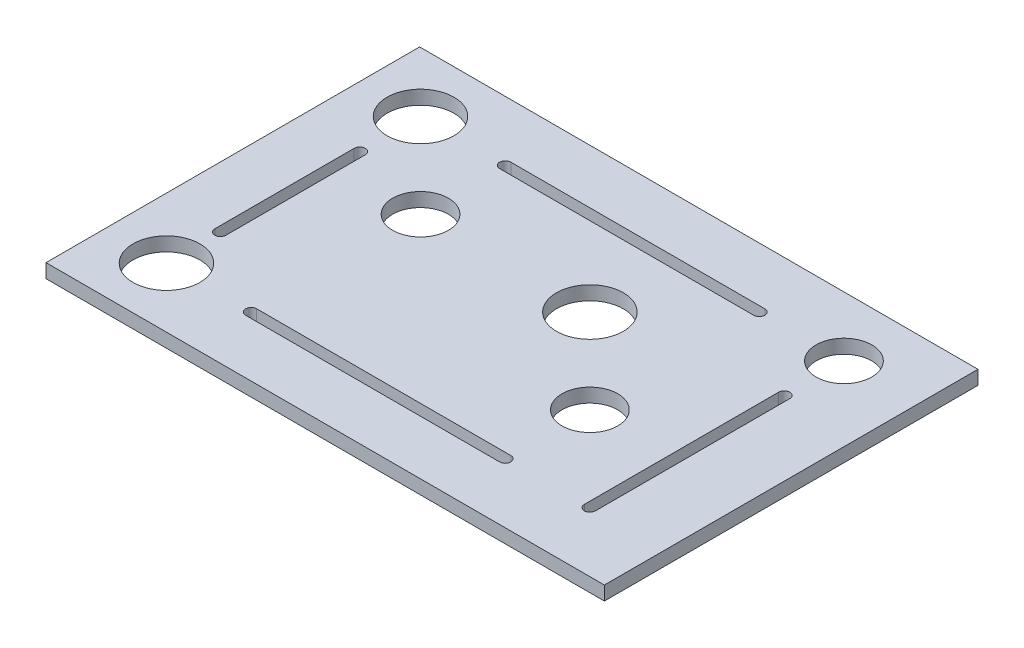
ISO-10303-21;
HEADER;
FILE_DESCRIPTION(('STEP AP214'),'2;1');
FILE_NAME('part.step','',(''),(''),'','','');
FILE_SCHEMA(('AUTOMOTIVE_DESIGN { 1 0 10303 214 1 1 1 1 }'));
ENDSEC;
DATA;
#1=APPLICATION_CONTEXT('core data for automotive mechanical design processes');
#2=APPLICATION_PROTOCOL_DEFINITION('international standard','automotive_design',2000,#1);
#3=PRODUCT_CONTEXT('',#1,'mechanical');
#4=PRODUCT('Part','Part','',(#3));
#5=PRODUCT_RELATED_PRODUCT_CATEGORY('part','',(#4));
#6=PRODUCT_DEFINITION_FORMATION('','',#4);
#7=PRODUCT_DEFINITION_CONTEXT('part definition',#1,'design');
#8=PRODUCT_DEFINITION('design','',#6,#7);
#9=PRODUCT_DEFINITION_SHAPE('','',#8);
#10=(LENGTH_UNIT() NAMED_UNIT(*) SI_UNIT(.MILLI.,.METRE.));
#11=(NAMED_UNIT(*) PLANE_ANGLE_UNIT() SI_UNIT($,.RADIAN.));
#12=(NAMED_UNIT(*) SI_UNIT($,.STERADIAN.) SOLID_ANGLE_UNIT());
#13=UNCERTAINTY_MEASURE_WITH_UNIT(LENGTH_MEASURE(1.E-05),#10,'distance_accuracy_value','');
#14=(GEOMETRIC_REPRESENTATION_CONTEXT(3) GLOBAL_UNCERTAINTY_ASSIGNED_CONTEXT((#13)) GLOBAL_UNIT_ASSIGNED_CONTEXT((#10,
#11,#12)) REPRESENTATION_CONTEXT('',''));
#15=CARTESIAN_POINT('',(0.,0.,0.));
#16=DIRECTION('',(0.,0.,1.));
#17=DIRECTION('',(1.,0.,0.));
#18=AXIS2_PLACEMENT_3D('',#15,#16,#17);
#19=CARTESIAN_POINT('',(0.,3.175,0.));
#20=DIRECTION('',(0.,0.,1.));
#21=DIRECTION('',(1.,0.,0.));
#22=AXIS2_PLACEMENT_3D('',#19,#20,#21);
#23=PLANE('',#22);
#24=DIRECTION('',(-1.,0.,0.));
#25=VECTOR('',#24,1.);
#26=CARTESIAN_POINT('',(0.,0.,0.));
#27=LINE('',#26,#25);
#28=CARTESIAN_POINT('',(0.,0.,0.));
#29=VERTEX_POINT('',#28);
#30=CARTESIAN_POINT('',(-127.25,0.,0.));
#31=VERTEX_POINT('',#30);
#32=EDGE_CURVE('E342',#29,#31,#27,.T.);
#33=ORIENTED_EDGE('',*,*,#32,.F.);
#34=DIRECTION('',(0.,-1.,0.));
#35=VECTOR('',#34,1.);
#36=CARTESIAN_POINT('',(0.,3.175,0.));
#37=LINE('',#36,#35);
#38=CARTESIAN_POINT('',(0.,3.175,0.));
#39=VERTEX_POINT('',#38);
#40=EDGE_CURVE('E11',#39,#29,#37,.T.);
#41=ORIENTED_EDGE('',*,*,#40,.F.);
#42=DIRECTION('',(-1.,0.,0.));
#43=VECTOR('',#42,1.);
#44=CARTESIAN_POINT('',(0.,3.175,0.));
#45=LINE('',#44,#43);
#46=CARTESIAN_POINT('',(-127.25,3.175,0.));
#47=VERTEX_POINT('',#46);
#48=EDGE_CURVE('E345',#39,#47,#45,.T.);
#49=ORIENTED_EDGE('',*,*,#48,.T.);
#50=DIRECTION('',(0.,-1.,0.));
#51=VECTOR('',#50,1.);
#52=CARTESIAN_POINT('',(-127.25,3.175,0.));
#53=LINE('',#52,#51);
#54=EDGE_CURVE('E41',#47,#31,#53,.T.);
#55=ORIENTED_EDGE('',*,*,#54,.T.);
#56=EDGE_LOOP('',(#33,#41,#49,#55));
#57=FACE_BOUND('',#56,.T.);
#58=ADVANCED_FACE('F38',(#57),#23,.T.);
#59=CARTESIAN_POINT('',(0.,3.175,0.));
#60=DIRECTION('',(-1.,0.,0.));
#61=DIRECTION('',(0.,0.,1.));
#62=AXIS2_PLACEMENT_3D('',#59,#60,#61);
#63=PLANE('',#62);
#64=DIRECTION('',(0.,0.,-1.));
#65=VECTOR('',#64,1.);
#66=CARTESIAN_POINT('',(0.,0.,0.));
#67=LINE('',#66,#65);
#68=CARTESIAN_POINT('',(0.,0.,-85.1500000000001));
#69=VERTEX_POINT('',#68);
#70=EDGE_CURVE('E349',#29,#69,#67,.T.);
#71=ORIENTED_EDGE('',*,*,#70,.T.);
#72=DIRECTION('',(0.,-1.,0.));
#73=VECTOR('',#72,1.);
#74=CARTESIAN_POINT('',(0.,3.175,-85.1500000000001));
#75=LINE('',#74,#73);
#76=CARTESIAN_POINT('',(0.,3.175,-85.1500000000001));
#77=VERTEX_POINT('',#76);
#78=EDGE_CURVE('E46',#77,#69,#75,.T.);
#79=ORIENTED_EDGE('',*,*,#78,.F.);
#80=DIRECTION('',(0.,0.,-1.));
#81=VECTOR('',#80,1.);
#82=CARTESIAN_POINT('',(0.,3.175,0.));
#83=LINE('',#82,#81);
#84=EDGE_CURVE('E354',#39,#77,#83,.T.);
#85=ORIENTED_EDGE('',*,*,#84,.F.);
#86=ORIENTED_EDGE('',*,*,#40,.T.);
#87=EDGE_LOOP('',(#71,#79,#85,#86));
#88=FACE_BOUND('',#87,.T.);
#89=ADVANCED_FACE('F380',(#88),#63,.F.);
#90=CARTESIAN_POINT('',(0.,3.175,-85.1500000000001));
#91=DIRECTION('',(0.,0.,1.));
#92=DIRECTION('',(1.,0.,0.));
#93=AXIS2_PLACEMENT_3D('',#90,#91,#92);
#94=PLANE('',#93);
#95=DIRECTION('',(-1.,0.,0.));
#96=VECTOR('',#95,1.);
#97=CARTESIAN_POINT('',(0.,0.,-85.1500000000001));
#98=LINE('',#97,#96);
#99=CARTESIAN_POINT('',(-127.25,0.,-85.15));
#100=VERTEX_POINT('',#99);
#101=EDGE_CURVE('E361',#69,#100,#98,.T.);
#102=ORIENTED_EDGE('',*,*,#101,.T.);
#103=DIRECTION('',(0.,-1.,0.));
#104=VECTOR('',#103,1.);
#105=CARTESIAN_POINT('',(-127.25,3.175,-85.15));
#106=LINE('',#105,#104);
#107=CARTESIAN_POINT('',(-127.25,3.175,-85.15));
#108=VERTEX_POINT('',#107);
#109=EDGE_CURVE('E366',#108,#100,#106,.T.);
#110=ORIENTED_EDGE('',*,*,#109,.F.);
#111=DIRECTION('',(-1.,0.,0.));
#112=VECTOR('',#111,1.);
#113=CARTESIAN_POINT('',(0.,3.175,-85.1500000000001));
#114=LINE('',#113,#112);
#115=EDGE_CURVE('E352',#77,#108,#114,.T.);
#116=ORIENTED_EDGE('',*,*,#115,.F.);
#117=ORIENTED_EDGE('',*,*,#78,.T.);
#118=EDGE_LOOP('',(#102,#110,#116,#117));
#119=FACE_BOUND('',#118,.T.);
#120=ADVANCED_FACE('F384',(#119),#94,.F.);
#121=CARTESIAN_POINT('',(-127.25,3.175,0.));
#122=DIRECTION('',(-1.,0.,0.));
#123=DIRECTION('',(0.,0.,1.));
#124=AXIS2_PLACEMENT_3D('',#121,#122,#123);
#125=PLANE('',#124);
#126=DIRECTION('',(0.,0.,-1.));
#127=VECTOR('',#126,1.);
#128=CARTESIAN_POINT('',(-127.25,0.,0.));
#129=LINE('',#128,#127);
#130=EDGE_CURVE('E358',#31,#100,#129,.T.);
#131=ORIENTED_EDGE('',*,*,#130,.F.);
#132=ORIENTED_EDGE('',*,*,#54,.F.);
#133=DIRECTION('',(0.,0.,-1.));
#134=VECTOR('',#133,1.);
#135=CARTESIAN_POINT('',(-127.25,3.175,0.));
#136=LINE('',#135,#134);
#137=EDGE_CURVE('E348',#47,#108,#136,.T.);
#138=ORIENTED_EDGE('',*,*,#137,.T.);
#139=ORIENTED_EDGE('',*,*,#109,.T.);
#140=EDGE_LOOP('',(#131,#132,#138,#139));
#141=FACE_BOUND('',#140,.T.);
#142=ADVANCED_FACE('F374',(#141),#125,.T.);
#143=CARTESIAN_POINT('',(0.,3.175,0.));
#144=DIRECTION('',(0.,-1.,0.));
#145=DIRECTION('',(0.,0.,-1.));
#146=AXIS2_PLACEMENT_3D('',#143,#144,#145);
#147=PLANE('',#146);
#148=DIRECTION('',(0.,0.,-1.));
#149=VECTOR('',#148,1.);
#150=CARTESIAN_POINT('',(-15.6549999999995,3.175,-13.6250000000001));
#151=LINE('',#150,#149);
#152=CARTESIAN_POINT('',(-15.6549999999995,3.175,-13.6250000000001));
#153=VERTEX_POINT('',#152);
#154=CARTESIAN_POINT('',(-15.6550000000003,3.175,-57.9140062974979));
#155=VERTEX_POINT('',#154);
#156=EDGE_CURVE('E205',#153,#155,#151,.T.);
#157=ORIENTED_EDGE('',*,*,#156,.F.);
#158=CARTESIAN_POINT('',(-16.9249999999998,3.175,-13.6250000000001));
#159=DIRECTION('',(0.,1.,0.));
#160=DIRECTION('',(0.,0.,1.));
#161=AXIS2_PLACEMENT_3D('',#158,#159,#160);
#162=CIRCLE('',#161,1.27);
#163=CARTESIAN_POINT('',(-18.1949999999995,3.175,-13.6250000000001));
#164=VERTEX_POINT('',#163);
#165=EDGE_CURVE('E54',#164,#153,#162,.T.);
#166=ORIENTED_EDGE('',*,*,#165,.F.);
#167=DIRECTION('',(0.,0.,1.));
#168=VECTOR('',#167,1.);
#169=CARTESIAN_POINT('',(-18.1949999999995,3.175,-13.6250000000001));
#170=LINE('',#169,#168);
#171=CARTESIAN_POINT('',(-18.1949999999995,3.175,-57.9140062974979));
#172=VERTEX_POINT('',#171);
#173=EDGE_CURVE('E196',#172,#164,#170,.T.);
#174=ORIENTED_EDGE('',*,*,#173,.F.);
#175=CARTESIAN_POINT('',(-16.925,3.175,-57.9140062974979));
#176=DIRECTION('',(0.,1.,0.));
#177=DIRECTION('',(0.,0.,1.));
#178=AXIS2_PLACEMENT_3D('',#175,#176,#177);
#179=CIRCLE('',#178,1.26999999999969);
#180=EDGE_CURVE('E199',#155,#172,#179,.T.);
#181=ORIENTED_EDGE('',*,*,#180,.F.);
#182=EDGE_LOOP('',(#157,#166,#174,#181));
#183=FACE_BOUND('',#182,.T.);
#184=DIRECTION('',(-1.,0.,0.));
#185=VECTOR('',#184,1.);
#186=CARTESIAN_POINT('',(-36.225,3.175,-72.7949999999999));
#187=LINE('',#186,#185);
#188=CARTESIAN_POINT('',(-36.225,3.175,-72.7949999999999));
#189=VERTEX_POINT('',#188);
#190=CARTESIAN_POINT('',(-94.125,3.175,-72.7949999999995));
#191=VERTEX_POINT('',#190);
#192=EDGE_CURVE('E231',#189,#191,#187,.T.);
#193=ORIENTED_EDGE('',*,*,#192,.F.);
#194=CARTESIAN_POINT('',(-36.225,3.175,-71.5249999999999));
#195=DIRECTION('',(0.,1.,0.));
#196=DIRECTION('',(0.,0.,1.));
#197=AXIS2_PLACEMENT_3D('',#194,#195,#196);
#198=CIRCLE('',#197,1.26999999999999);
#199=CARTESIAN_POINT('',(-36.225,3.175,-70.2549999999999));
#200=VERTEX_POINT('',#199);
#201=EDGE_CURVE('E62',#200,#189,#198,.T.);
#202=ORIENTED_EDGE('',*,*,#201,.F.);
#203=DIRECTION('',(1.,0.,0.));
#204=VECTOR('',#203,1.);
#205=CARTESIAN_POINT('',(-36.225,3.175,-70.2549999999999));
#206=LINE('',#205,#204);
#207=CARTESIAN_POINT('',(-94.125,3.175,-70.2549999999999));
#208=VERTEX_POINT('',#207);
#209=EDGE_CURVE('E220',#208,#200,#206,.T.);
#210=ORIENTED_EDGE('',*,*,#209,.F.);
#211=CARTESIAN_POINT('',(-94.125,3.175,-71.5249999999995));
#212=DIRECTION('',(0.,1.,0.));
#213=DIRECTION('',(0.,0.,1.));
#214=AXIS2_PLACEMENT_3D('',#211,#212,#213);
#215=CIRCLE('',#214,1.27);
#216=EDGE_CURVE('E235',#191,#208,#215,.T.);
#217=ORIENTED_EDGE('',*,*,#216,.F.);
#218=EDGE_LOOP('',(#193,#202,#210,#217));
#219=FACE_BOUND('',#218,.T.);
#220=DIRECTION('',(0.,0.,-1.));
#221=VECTOR('',#220,1.);
#222=CARTESIAN_POINT('',(-112.155,3.175,-25.9052815058638));
#223=LINE('',#222,#221);
#224=CARTESIAN_POINT('',(-112.155,3.175,-25.9052815058638));
#225=VERTEX_POINT('',#224);
#226=CARTESIAN_POINT('',(-112.155,3.175,-57.6832088778083));
#227=VERTEX_POINT('',#226);
#228=EDGE_CURVE('E262',#225,#227,#223,.T.);
#229=ORIENTED_EDGE('',*,*,#228,.F.);
#230=CARTESIAN_POINT('',(-113.425,3.175,-25.9052815058638));
#231=DIRECTION('',(0.,1.,0.));
#232=DIRECTION('',(0.,0.,1.));
#233=AXIS2_PLACEMENT_3D('',#230,#231,#232);
#234=CIRCLE('',#233,1.26999999999999);
#235=CARTESIAN_POINT('',(-114.695,3.175,-25.9052815058638));
#236=VERTEX_POINT('',#235);
#237=EDGE_CURVE('E260',#236,#225,#234,.T.);
#238=ORIENTED_EDGE('',*,*,#237,.F.);
#239=DIRECTION('',(0.,0.,1.));
#240=VECTOR('',#239,1.);
#241=CARTESIAN_POINT('',(-114.695,3.175,-25.9052815058638));
#242=LINE('',#241,#240);
#243=CARTESIAN_POINT('',(-114.695,3.175,-57.6832088778083));
#244=VERTEX_POINT('',#243);
#245=EDGE_CURVE('E250',#244,#236,#242,.T.);
#246=ORIENTED_EDGE('',*,*,#245,.F.);
#247=CARTESIAN_POINT('',(-113.425,3.175,-57.6832088778083));
#248=DIRECTION('',(0.,1.,0.));
#249=DIRECTION('',(0.,0.,1.));
#250=AXIS2_PLACEMENT_3D('',#247,#248,#249);
#251=CIRCLE('',#250,1.26999999999999);
#252=EDGE_CURVE('E266',#227,#244,#251,.T.);
#253=ORIENTED_EDGE('',*,*,#252,.F.);
#254=EDGE_LOOP('',(#229,#238,#246,#253));
#255=FACE_BOUND('',#254,.T.);
#256=DIRECTION('',(-1.,0.,0.));
#257=VECTOR('',#256,1.);
#258=CARTESIAN_POINT('',(-36.225,3.175,-14.8950000000001));
#259=LINE('',#258,#257);
#260=CARTESIAN_POINT('',(-36.225,3.175,-14.8950000000001));
#261=VERTEX_POINT('',#260);
#262=CARTESIAN_POINT('',(-94.125,3.175,-14.8950000000001));
#263=VERTEX_POINT('',#262);
#264=EDGE_CURVE('E294',#261,#263,#259,.T.);
#265=ORIENTED_EDGE('',*,*,#264,.F.);
#266=CARTESIAN_POINT('',(-36.225,3.175,-13.6250000000001));
#267=DIRECTION('',(0.,1.,0.));
#268=DIRECTION('',(0.,0.,-1.));
#269=AXIS2_PLACEMENT_3D('',#266,#267,#268);
#270=CIRCLE('',#269,1.26999999999999);
#271=CARTESIAN_POINT('',(-36.225,3.175,-12.3550000000001));
#272=VERTEX_POINT('',#271);
#273=EDGE_CURVE('E292',#272,#261,#270,.T.);
#274=ORIENTED_EDGE('',*,*,#273,.F.);
#275=DIRECTION('',(1.,0.,0.));
#276=VECTOR('',#275,1.);
#277=CARTESIAN_POINT('',(-36.225,3.175,-12.3550000000001));
#278=LINE('',#277,#276);
#279=CARTESIAN_POINT('',(-94.125,3.175,-12.3550000000005));
#280=VERTEX_POINT('',#279);
#281=EDGE_CURVE('E282',#280,#272,#278,.T.);
#282=ORIENTED_EDGE('',*,*,#281,.F.);
#283=CARTESIAN_POINT('',(-94.125,3.175,-13.6250000000005));
#284=DIRECTION('',(0.,1.,0.));
#285=DIRECTION('',(0.,0.,-1.));
#286=AXIS2_PLACEMENT_3D('',#283,#284,#285);
#287=CIRCLE('',#286,1.27);
#288=EDGE_CURVE('E297',#263,#280,#287,.T.);
#289=ORIENTED_EDGE('',*,*,#288,.F.);
#290=EDGE_LOOP('',(#265,#274,#282,#289));
#291=FACE_BOUND('',#290,.T.);
#292=CARTESIAN_POINT('',(-113.425,3.175,-71.5249999999994));
#293=DIRECTION('',(0.,-1.,0.));
#294=DIRECTION('',(0.,0.,-1.));
#295=AXIS2_PLACEMENT_3D('',#292,#293,#294);
#296=CIRCLE('',#295,7.62);
#297=CARTESIAN_POINT('',(-113.425,3.175,-79.1449999999994));
#298=VERTEX_POINT('',#297);
#299=EDGE_CURVE('E309',#298,#298,#296,.T.);
#300=ORIENTED_EDGE('',*,*,#299,.T.);
#301=EDGE_LOOP('',(#300));
#302=FACE_BOUND('',#301,.T.);
#303=CARTESIAN_POINT('',(-113.425,3.175,-13.6249999999994));
#304=DIRECTION('',(0.,-1.,0.));
#305=DIRECTION('',(0.,0.,-1.));
#306=AXIS2_PLACEMENT_3D('',#303,#304,#305);
#307=CIRCLE('',#306,7.62);
#308=CARTESIAN_POINT('',(-113.425,3.175,-21.2449999999994));
#309=VERTEX_POINT('',#308);
#310=EDGE_CURVE('E316',#309,#309,#307,.T.);
#311=ORIENTED_EDGE('',*,*,#310,.T.);
#312=EDGE_LOOP('',(#311));
#313=FACE_BOUND('',#312,.T.);
#314=CARTESIAN_POINT('',(-94.125,3.175,-52.2249999999995));
#315=DIRECTION('',(0.,-1.,0.));
#316=DIRECTION('',(0.,0.,-1.));
#317=AXIS2_PLACEMENT_3D('',#314,#315,#316);
#318=CIRCLE('',#317,6.35);
#319=CARTESIAN_POINT('',(-94.125,3.175,-58.5749999999995));
#320=VERTEX_POINT('',#319);
#321=EDGE_CURVE('E322',#320,#320,#318,.T.);
#322=ORIENTED_EDGE('',*,*,#321,.T.);
#323=EDGE_LOOP('',(#322));
#324=FACE_BOUND('',#323,.T.);
#325=CARTESIAN_POINT('',(-55.5249999999998,3.175,-52.2249999999998));
#326=DIRECTION('',(0.,-1.,0.));
#327=DIRECTION('',(0.,0.,-1.));
#328=AXIS2_PLACEMENT_3D('',#325,#326,#327);
#329=CIRCLE('',#328,7.62);
#330=CARTESIAN_POINT('',(-55.5249999999998,3.175,-59.8449999999998));
#331=VERTEX_POINT('',#330);
#332=EDGE_CURVE('E328',#331,#331,#329,.T.);
#333=ORIENTED_EDGE('',*,*,#332,.T.);
#334=EDGE_LOOP('',(#333));
#335=FACE_BOUND('',#334,.T.);
#336=CARTESIAN_POINT('',(-36.2249999999996,3.175,-32.9249999999999));
#337=DIRECTION('',(0.,-1.,0.));
#338=DIRECTION('',(0.,0.,-1.));
#339=AXIS2_PLACEMENT_3D('',#336,#337,#338);
#340=CIRCLE('',#339,6.35);
#341=CARTESIAN_POINT('',(-36.2249999999996,3.175,-39.2749999999999));
#342=VERTEX_POINT('',#341);
#343=EDGE_CURVE('E334',#342,#342,#340,.T.);
#344=ORIENTED_EDGE('',*,*,#343,.T.);
#345=EDGE_LOOP('',(#344));
#346=FACE_BOUND('',#345,.T.);
#347=CARTESIAN_POINT('',(-16.925,3.175,-71.5250000000001));
#348=DIRECTION('',(0.,1.,0.));
#349=DIRECTION('',(0.,0.,1.));
#350=AXIS2_PLACEMENT_3D('',#347,#348,#349);
#351=CIRCLE('',#350,6.35);
#352=CARTESIAN_POINT('',(-16.925,3.175,-65.1750000000001));
#353=VERTEX_POINT('',#352);
#354=EDGE_CURVE('E312',#353,#353,#351,.T.);
#355=ORIENTED_EDGE('',*,*,#354,.F.);
#356=EDGE_LOOP('',(#355));
#357=FACE_BOUND('',#356,.T.);
#358=ORIENTED_EDGE('',*,*,#48,.F.);
#359=ORIENTED_EDGE('',*,*,#84,.T.);
#360=ORIENTED_EDGE('',*,*,#115,.T.);
#361=ORIENTED_EDGE('',*,*,#137,.F.);
#362=EDGE_LOOP('',(#358,#359,#360,#361));
#363=FACE_BOUND('',#362,.T.);
#364=ADVANCED_FACE('F386',(#183,#219,#255,#291,#302,#313,#324,#335,#346,#357,#363),#147,.F.);
#365=CARTESIAN_POINT('',(0.,0.,0.));
#366=DIRECTION('',(0.,-1.,0.));
#367=DIRECTION('',(0.,0.,-1.));
#368=AXIS2_PLACEMENT_3D('',#365,#366,#367);
#369=PLANE('',#368);
#370=CARTESIAN_POINT('',(-16.9249999999998,0.,-13.6250000000001));
#371=DIRECTION('',(0.,1.,0.));
#372=DIRECTION('',(0.,0.,1.));
#373=AXIS2_PLACEMENT_3D('',#370,#371,#372);
#374=CIRCLE('',#373,1.27);
#375=CARTESIAN_POINT('',(-18.1949999999995,0.,-13.6250000000001));
#376=VERTEX_POINT('',#375);
#377=CARTESIAN_POINT('',(-15.6549999999995,0.,-13.6250000000001));
#378=VERTEX_POINT('',#377);
#379=EDGE_CURVE('E177',#376,#378,#374,.T.);
#380=ORIENTED_EDGE('',*,*,#379,.T.);
#381=DIRECTION('',(0.,0.,-1.));
#382=VECTOR('',#381,1.);
#383=CARTESIAN_POINT('',(-15.6549999999995,0.,-13.6250000000001));
#384=LINE('',#383,#382);
#385=CARTESIAN_POINT('',(-15.6550000000001,0.,-57.9140062974979));
#386=VERTEX_POINT('',#385);
#387=EDGE_CURVE('E187',#378,#386,#384,.T.);
#388=ORIENTED_EDGE('',*,*,#387,.T.);
#389=CARTESIAN_POINT('',(-16.925,0.,-57.9140062974979));
#390=DIRECTION('',(0.,1.,0.));
#391=DIRECTION('',(0.,0.,1.));
#392=AXIS2_PLACEMENT_3D('',#389,#390,#391);
#393=CIRCLE('',#392,1.26999999999969);
#394=CARTESIAN_POINT('',(-18.1949999999995,0.,-57.9140062974979));
#395=VERTEX_POINT('',#394);
#396=EDGE_CURVE('E191',#386,#395,#393,.T.);
#397=ORIENTED_EDGE('',*,*,#396,.T.);
#398=DIRECTION('',(0.,0.,1.));
#399=VECTOR('',#398,1.);
#400=CARTESIAN_POINT('',(-18.1949999999995,0.,-13.6250000000001));
#401=LINE('',#400,#399);
#402=EDGE_CURVE('E183',#395,#376,#401,.T.);
#403=ORIENTED_EDGE('',*,*,#402,.T.);
#404=EDGE_LOOP('',(#380,#388,#397,#403));
#405=FACE_BOUND('',#404,.T.);
#406=CARTESIAN_POINT('',(-36.225,0.,-71.5249999999999));
#407=DIRECTION('',(0.,1.,0.));
#408=DIRECTION('',(0.,0.,1.));
#409=AXIS2_PLACEMENT_3D('',#406,#407,#408);
#410=CIRCLE('',#409,1.26999999999999);
#411=CARTESIAN_POINT('',(-36.225,0.,-70.2549999999999));
#412=VERTEX_POINT('',#411);
#413=CARTESIAN_POINT('',(-36.225,0.,-72.7949999999999));
#414=VERTEX_POINT('',#413);
#415=EDGE_CURVE('E216',#412,#414,#410,.T.);
#416=ORIENTED_EDGE('',*,*,#415,.T.);
#417=DIRECTION('',(-1.,0.,0.));
#418=VECTOR('',#417,1.);
#419=CARTESIAN_POINT('',(-36.225,0.,-72.7949999999999));
#420=LINE('',#419,#418);
#421=CARTESIAN_POINT('',(-94.125,0.,-72.7949999999999));
#422=VERTEX_POINT('',#421);
#423=EDGE_CURVE('E219',#414,#422,#420,.T.);
#424=ORIENTED_EDGE('',*,*,#423,.T.);
#425=CARTESIAN_POINT('',(-94.125,0.,-71.5249999999995));
#426=DIRECTION('',(0.,1.,0.));
#427=DIRECTION('',(0.,0.,1.));
#428=AXIS2_PLACEMENT_3D('',#425,#426,#427);
#429=CIRCLE('',#428,1.27);
#430=CARTESIAN_POINT('',(-94.125,0.,-70.2549999999999));
#431=VERTEX_POINT('',#430);
#432=EDGE_CURVE('E223',#422,#431,#429,.T.);
#433=ORIENTED_EDGE('',*,*,#432,.T.);
#434=DIRECTION('',(1.,0.,0.));
#435=VECTOR('',#434,1.);
#436=CARTESIAN_POINT('',(-36.225,0.,-70.2549999999999));
#437=LINE('',#436,#435);
#438=EDGE_CURVE('E226',#431,#412,#437,.T.);
#439=ORIENTED_EDGE('',*,*,#438,.T.);
#440=EDGE_LOOP('',(#416,#424,#433,#439));
#441=FACE_BOUND('',#440,.T.);
#442=CARTESIAN_POINT('',(-113.425,0.,-25.9052815058638));
#443=DIRECTION('',(0.,1.,0.));
#444=DIRECTION('',(0.,0.,1.));
#445=AXIS2_PLACEMENT_3D('',#442,#443,#444);
#446=CIRCLE('',#445,1.26999999999999);
#447=CARTESIAN_POINT('',(-114.695,0.,-25.9052815058638));
#448=VERTEX_POINT('',#447);
#449=CARTESIAN_POINT('',(-112.155,0.,-25.9052815058638));
#450=VERTEX_POINT('',#449);
#451=EDGE_CURVE('E246',#448,#450,#446,.T.);
#452=ORIENTED_EDGE('',*,*,#451,.T.);
#453=DIRECTION('',(0.,0.,-1.));
#454=VECTOR('',#453,1.);
#455=CARTESIAN_POINT('',(-112.155,0.,-25.9052815058638));
#456=LINE('',#455,#454);
#457=CARTESIAN_POINT('',(-112.155,0.,-57.6832088778083));
#458=VERTEX_POINT('',#457);
#459=EDGE_CURVE('E249',#450,#458,#456,.T.);
#460=ORIENTED_EDGE('',*,*,#459,.T.);
#461=CARTESIAN_POINT('',(-113.425,0.,-57.6832088778083));
#462=DIRECTION('',(0.,1.,0.));
#463=DIRECTION('',(0.,0.,1.));
#464=AXIS2_PLACEMENT_3D('',#461,#462,#463);
#465=CIRCLE('',#464,1.26999999999999);
#466=CARTESIAN_POINT('',(-114.695,0.,-57.6832088778083));
#467=VERTEX_POINT('',#466);
#468=EDGE_CURVE('E253',#458,#467,#465,.T.);
#469=ORIENTED_EDGE('',*,*,#468,.T.);
#470=DIRECTION('',(0.,0.,1.));
#471=VECTOR('',#470,1.);
#472=CARTESIAN_POINT('',(-114.695,0.,-25.9052815058638));
#473=LINE('',#472,#471);
#474=EDGE_CURVE('E256',#467,#448,#473,.T.);
#475=ORIENTED_EDGE('',*,*,#474,.T.);
#476=EDGE_LOOP('',(#452,#460,#469,#475));
#477=FACE_BOUND('',#476,.T.);
#478=CARTESIAN_POINT('',(-36.225,0.,-13.6250000000001));
#479=DIRECTION('',(0.,1.,0.));
#480=DIRECTION('',(0.,0.,-1.));
#481=AXIS2_PLACEMENT_3D('',#478,#479,#480);
#482=CIRCLE('',#481,1.26999999999999);
#483=CARTESIAN_POINT('',(-36.225,0.,-12.3550000000001));
#484=VERTEX_POINT('',#483);
#485=CARTESIAN_POINT('',(-36.225,0.,-14.8950000000001));
#486=VERTEX_POINT('',#485);
#487=EDGE_CURVE('E278',#484,#486,#482,.T.);
#488=ORIENTED_EDGE('',*,*,#487,.T.);
#489=DIRECTION('',(-1.,0.,0.));
#490=VECTOR('',#489,1.);
#491=CARTESIAN_POINT('',(-36.225,0.,-14.8950000000001));
#492=LINE('',#491,#490);
#493=CARTESIAN_POINT('',(-94.125,0.,-14.8950000000001));
#494=VERTEX_POINT('',#493);
#495=EDGE_CURVE('E281',#486,#494,#492,.T.);
#496=ORIENTED_EDGE('',*,*,#495,.T.);
#497=CARTESIAN_POINT('',(-94.125,0.,-13.6250000000005));
#498=DIRECTION('',(0.,1.,0.));
#499=DIRECTION('',(0.,0.,-1.));
#500=AXIS2_PLACEMENT_3D('',#497,#498,#499);
#501=CIRCLE('',#500,1.27);
#502=CARTESIAN_POINT('',(-94.125,0.,-12.3550000000005));
#503=VERTEX_POINT('',#502);
#504=EDGE_CURVE('E285',#494,#503,#501,.T.);
#505=ORIENTED_EDGE('',*,*,#504,.T.);
#506=DIRECTION('',(1.,0.,0.));
#507=VECTOR('',#506,1.);
#508=CARTESIAN_POINT('',(-36.225,0.,-12.3550000000001));
#509=LINE('',#508,#507);
#510=EDGE_CURVE('E288',#503,#484,#509,.T.);
#511=ORIENTED_EDGE('',*,*,#510,.T.);
#512=EDGE_LOOP('',(#488,#496,#505,#511));
#513=FACE_BOUND('',#512,.T.);
#514=CARTESIAN_POINT('',(-113.425,0.,-71.5249999999994));
#515=DIRECTION('',(0.,-1.,0.));
#516=DIRECTION('',(0.,0.,-1.));
#517=AXIS2_PLACEMENT_3D('',#514,#515,#516);
#518=CIRCLE('',#517,7.62);
#519=CARTESIAN_POINT('',(-113.425,0.,-79.1449999999994));
#520=VERTEX_POINT('',#519);
#521=EDGE_CURVE('E313',#520,#520,#518,.T.);
#522=ORIENTED_EDGE('',*,*,#521,.F.);
#523=EDGE_LOOP('',(#522));
#524=FACE_BOUND('',#523,.T.);
#525=CARTESIAN_POINT('',(-113.425,0.,-13.6249999999994));
#526=DIRECTION('',(0.,-1.,0.));
#527=DIRECTION('',(0.,0.,-1.));
#528=AXIS2_PLACEMENT_3D('',#525,#526,#527);
#529=CIRCLE('',#528,7.62);
#530=CARTESIAN_POINT('',(-113.425,0.,-21.2449999999994));
#531=VERTEX_POINT('',#530);
#532=EDGE_CURVE('E319',#531,#531,#529,.T.);
#533=ORIENTED_EDGE('',*,*,#532,.F.);
#534=EDGE_LOOP('',(#533));
#535=FACE_BOUND('',#534,.T.);
#536=CARTESIAN_POINT('',(-94.125,0.,-52.2249999999995));
#537=DIRECTION('',(0.,-1.,0.));
#538=DIRECTION('',(0.,0.,-1.));
#539=AXIS2_PLACEMENT_3D('',#536,#537,#538);
#540=CIRCLE('',#539,6.35);
#541=CARTESIAN_POINT('',(-94.125,0.,-58.5749999999995));
#542=VERTEX_POINT('',#541);
#543=EDGE_CURVE('E325',#542,#542,#540,.T.);
#544=ORIENTED_EDGE('',*,*,#543,.F.);
#545=EDGE_LOOP('',(#544));
#546=FACE_BOUND('',#545,.T.);
#547=CARTESIAN_POINT('',(-55.5249999999998,0.,-52.2249999999998));
#548=DIRECTION('',(0.,-1.,0.));
#549=DIRECTION('',(0.,0.,-1.));
#550=AXIS2_PLACEMENT_3D('',#547,#548,#549);
#551=CIRCLE('',#550,7.62);
#552=CARTESIAN_POINT('',(-55.5249999999998,0.,-59.8449999999998));
#553=VERTEX_POINT('',#552);
#554=EDGE_CURVE('E331',#553,#553,#551,.T.);
#555=ORIENTED_EDGE('',*,*,#554,.F.);
#556=EDGE_LOOP('',(#555));
#557=FACE_BOUND('',#556,.T.);
#558=CARTESIAN_POINT('',(-36.2249999999996,0.,-32.9249999999999));
#559=DIRECTION('',(0.,-1.,0.));
#560=DIRECTION('',(0.,0.,-1.));
#561=AXIS2_PLACEMENT_3D('',#558,#559,#560);
#562=CIRCLE('',#561,6.35);
#563=CARTESIAN_POINT('',(-36.2249999999996,0.,-39.2749999999999));
#564=VERTEX_POINT('',#563);
#565=EDGE_CURVE('E212',#564,#564,#562,.T.);
#566=ORIENTED_EDGE('',*,*,#565,.F.);
#567=EDGE_LOOP('',(#566));
#568=FACE_BOUND('',#567,.T.);
#569=CARTESIAN_POINT('',(-16.925,0.,-71.5250000000001));
#570=DIRECTION('',(0.,1.,0.));
#571=DIRECTION('',(0.,0.,1.));
#572=AXIS2_PLACEMENT_3D('',#569,#570,#571);
#573=CIRCLE('',#572,6.35);
#574=CARTESIAN_POINT('',(-16.925,0.,-65.1750000000001));
#575=VERTEX_POINT('',#574);
#576=EDGE_CURVE('E339',#575,#575,#573,.T.);
#577=ORIENTED_EDGE('',*,*,#576,.T.);
#578=EDGE_LOOP('',(#577));
#579=FACE_BOUND('',#578,.T.);
#580=ORIENTED_EDGE('',*,*,#32,.T.);
#581=ORIENTED_EDGE('',*,*,#130,.T.);
#582=ORIENTED_EDGE('',*,*,#101,.F.);
#583=ORIENTED_EDGE('',*,*,#70,.F.);
#584=EDGE_LOOP('',(#580,#581,#582,#583));
#585=FACE_BOUND('',#584,.T.);
#586=ADVANCED_FACE('F193',(#405,#441,#477,#513,#524,#535,#546,#557,#568,#579,#585),#369,.T.);
#587=CARTESIAN_POINT('',(-16.925,0.,-71.5250000000001));
#588=DIRECTION('',(0.,1.,0.));
#589=DIRECTION('',(0.,0.,1.));
#590=AXIS2_PLACEMENT_3D('',#587,#588,#589);
#591=CYLINDRICAL_SURFACE('',#590,6.35);
#592=ORIENTED_EDGE('',*,*,#576,.F.);
#593=EDGE_LOOP('',(#592));
#594=FACE_BOUND('',#593,.T.);
#595=ORIENTED_EDGE('',*,*,#354,.T.);
#596=EDGE_LOOP('',(#595));
#597=FACE_BOUND('',#596,.T.);
#598=ADVANCED_FACE('F394',(#594,#597),#591,.F.);
#599=CARTESIAN_POINT('',(-36.2249999999996,3.175,-32.9249999999999));
#600=DIRECTION('',(0.,-1.,0.));
#601=DIRECTION('',(0.,0.,-1.));
#602=AXIS2_PLACEMENT_3D('',#599,#600,#601);
#603=CYLINDRICAL_SURFACE('',#602,6.35);
#604=ORIENTED_EDGE('',*,*,#343,.F.);
#605=EDGE_LOOP('',(#604));
#606=FACE_BOUND('',#605,.T.);
#607=ORIENTED_EDGE('',*,*,#565,.T.);
#608=EDGE_LOOP('',(#607));
#609=FACE_BOUND('',#608,.T.);
#610=ADVANCED_FACE('F423',(#606,#609),#603,.F.);
#611=CARTESIAN_POINT('',(-55.5249999999998,3.175,-52.2249999999998));
#612=DIRECTION('',(0.,-1.,0.));
#613=DIRECTION('',(0.,0.,-1.));
#614=AXIS2_PLACEMENT_3D('',#611,#612,#613);
#615=CYLINDRICAL_SURFACE('',#614,7.62);
#616=ORIENTED_EDGE('',*,*,#332,.F.);
#617=EDGE_LOOP('',(#616));
#618=FACE_BOUND('',#617,.T.);
#619=ORIENTED_EDGE('',*,*,#554,.T.);
#620=EDGE_LOOP('',(#619));
#621=FACE_BOUND('',#620,.T.);
#622=ADVANCED_FACE('F433',(#618,#621),#615,.F.);
#623=CARTESIAN_POINT('',(-94.125,3.175,-52.2249999999995));
#624=DIRECTION('',(0.,-1.,0.));
#625=DIRECTION('',(0.,0.,-1.));
#626=AXIS2_PLACEMENT_3D('',#623,#624,#625);
#627=CYLINDRICAL_SURFACE('',#626,6.35);
#628=ORIENTED_EDGE('',*,*,#321,.F.);
#629=EDGE_LOOP('',(#628));
#630=FACE_BOUND('',#629,.T.);
#631=ORIENTED_EDGE('',*,*,#543,.T.);
#632=EDGE_LOOP('',(#631));
#633=FACE_BOUND('',#632,.T.);
#634=ADVANCED_FACE('F443',(#630,#633),#627,.F.);
#635=CARTESIAN_POINT('',(-113.425,3.175,-13.6249999999994));
#636=DIRECTION('',(0.,-1.,0.));
#637=DIRECTION('',(0.,0.,-1.));
#638=AXIS2_PLACEMENT_3D('',#635,#636,#637);
#639=CYLINDRICAL_SURFACE('',#638,7.62);
#640=ORIENTED_EDGE('',*,*,#310,.F.);
#641=EDGE_LOOP('',(#640));
#642=FACE_BOUND('',#641,.T.);
#643=ORIENTED_EDGE('',*,*,#532,.T.);
#644=EDGE_LOOP('',(#643));
#645=FACE_BOUND('',#644,.T.);
#646=ADVANCED_FACE('F453',(#642,#645),#639,.F.);
#647=CARTESIAN_POINT('',(-113.425,3.175,-71.5249999999994));
#648=DIRECTION('',(0.,-1.,0.));
#649=DIRECTION('',(0.,0.,-1.));
#650=AXIS2_PLACEMENT_3D('',#647,#648,#649);
#651=CYLINDRICAL_SURFACE('',#650,7.62);
#652=ORIENTED_EDGE('',*,*,#299,.F.);
#653=EDGE_LOOP('',(#652));
#654=FACE_BOUND('',#653,.T.);
#655=ORIENTED_EDGE('',*,*,#521,.T.);
#656=EDGE_LOOP('',(#655));
#657=FACE_BOUND('',#656,.T.);
#658=ADVANCED_FACE('F463',(#654,#657),#651,.F.);
#659=CARTESIAN_POINT('',(-36.225,0.,-13.6250000000001));
#660=DIRECTION('',(0.,1.,0.));
#661=DIRECTION('',(0.,0.,1.));
#662=AXIS2_PLACEMENT_3D('',#659,#660,#661);
#663=CYLINDRICAL_SURFACE('',#662,1.26999999999999);
#664=ORIENTED_EDGE('',*,*,#273,.T.);
#665=DIRECTION('',(0.,1.,0.));
#666=VECTOR('',#665,1.);
#667=CARTESIAN_POINT('',(-36.225,0.,-14.8950000000001));
#668=LINE('',#667,#666);
#669=EDGE_CURVE('E291',#486,#261,#668,.T.);
#670=ORIENTED_EDGE('',*,*,#669,.F.);
#671=ORIENTED_EDGE('',*,*,#487,.F.);
#672=DIRECTION('',(0.,1.,0.));
#673=VECTOR('',#672,1.);
#674=CARTESIAN_POINT('',(-36.225,0.,-12.3550000000001));
#675=LINE('',#674,#673);
#676=EDGE_CURVE('E263',#484,#272,#675,.T.);
#677=ORIENTED_EDGE('',*,*,#676,.T.);
#678=EDGE_LOOP('',(#664,#670,#671,#677));
#679=FACE_BOUND('',#678,.T.);
#680=ADVANCED_FACE('F472',(#679),#663,.F.);
#681=CARTESIAN_POINT('',(-36.225,0.,-12.3550000000001));
#682=DIRECTION('',(0.,0.,1.));
#683=DIRECTION('',(1.,0.,0.));
#684=AXIS2_PLACEMENT_3D('',#681,#682,#683);
#685=PLANE('',#684);
#686=ORIENTED_EDGE('',*,*,#281,.T.);
#687=ORIENTED_EDGE('',*,*,#676,.F.);
#688=ORIENTED_EDGE('',*,*,#510,.F.);
#689=DIRECTION('',(0.,1.,0.));
#690=VECTOR('',#689,1.);
#691=CARTESIAN_POINT('',(-94.125,0.,-12.3550000000005));
#692=LINE('',#691,#690);
#693=EDGE_CURVE('E303',#503,#280,#692,.T.);
#694=ORIENTED_EDGE('',*,*,#693,.T.);
#695=EDGE_LOOP('',(#686,#687,#688,#694));
#696=FACE_BOUND('',#695,.T.);
#697=ADVANCED_FACE('F491',(#696),#685,.F.);
#698=CARTESIAN_POINT('',(-94.125,0.,-13.6250000000005));
#699=DIRECTION('',(0.,1.,0.));
#700=DIRECTION('',(0.,0.,1.));
#701=AXIS2_PLACEMENT_3D('',#698,#699,#700);
#702=CYLINDRICAL_SURFACE('',#701,1.27);
#703=ORIENTED_EDGE('',*,*,#288,.T.);
#704=ORIENTED_EDGE('',*,*,#693,.F.);
#705=ORIENTED_EDGE('',*,*,#504,.F.);
#706=DIRECTION('',(0.,1.,0.));
#707=VECTOR('',#706,1.);
#708=CARTESIAN_POINT('',(-94.125,0.,-14.8950000000001));
#709=LINE('',#708,#707);
#710=EDGE_CURVE('E305',#494,#263,#709,.T.);
#711=ORIENTED_EDGE('',*,*,#710,.T.);
#712=EDGE_LOOP('',(#703,#704,#705,#711));
#713=FACE_BOUND('',#712,.T.);
#714=ADVANCED_FACE('F501',(#713),#702,.F.);
#715=CARTESIAN_POINT('',(-36.225,0.,-14.8950000000001));
#716=DIRECTION('',(0.,0.,-1.));
#717=DIRECTION('',(-1.,0.,0.));
#718=AXIS2_PLACEMENT_3D('',#715,#716,#717);
#719=PLANE('',#718);
#720=ORIENTED_EDGE('',*,*,#264,.T.);
#721=ORIENTED_EDGE('',*,*,#710,.F.);
#722=ORIENTED_EDGE('',*,*,#495,.F.);
#723=ORIENTED_EDGE('',*,*,#669,.T.);
#724=EDGE_LOOP('',(#720,#721,#722,#723));
#725=FACE_BOUND('',#724,.T.);
#726=ADVANCED_FACE('F511',(#725),#719,.F.);
#727=CARTESIAN_POINT('',(-113.425,0.,-25.9052815058638));
#728=DIRECTION('',(0.,1.,0.));
#729=DIRECTION('',(0.,0.,1.));
#730=AXIS2_PLACEMENT_3D('',#727,#728,#729);
#731=CYLINDRICAL_SURFACE('',#730,1.26999999999999);
#732=ORIENTED_EDGE('',*,*,#237,.T.);
#733=DIRECTION('',(0.,1.,0.));
#734=VECTOR('',#733,1.);
#735=CARTESIAN_POINT('',(-112.155,0.,-25.9052815058638));
#736=LINE('',#735,#734);
#737=EDGE_CURVE('E259',#450,#225,#736,.T.);
#738=ORIENTED_EDGE('',*,*,#737,.F.);
#739=ORIENTED_EDGE('',*,*,#451,.F.);
#740=DIRECTION('',(0.,1.,0.));
#741=VECTOR('',#740,1.);
#742=CARTESIAN_POINT('',(-114.695,0.,-25.9052815058638));
#743=LINE('',#742,#741);
#744=EDGE_CURVE('E232',#448,#236,#743,.T.);
#745=ORIENTED_EDGE('',*,*,#744,.T.);
#746=EDGE_LOOP('',(#732,#738,#739,#745));
#747=FACE_BOUND('',#746,.T.);
#748=ADVANCED_FACE('F521',(#747),#731,.F.);
#749=CARTESIAN_POINT('',(-114.695,0.,-25.9052815058638));
#750=DIRECTION('',(-1.,0.,0.));
#751=DIRECTION('',(0.,0.,1.));
#752=AXIS2_PLACEMENT_3D('',#749,#750,#751);
#753=PLANE('',#752);
#754=ORIENTED_EDGE('',*,*,#245,.T.);
#755=ORIENTED_EDGE('',*,*,#744,.F.);
#756=ORIENTED_EDGE('',*,*,#474,.F.);
#757=DIRECTION('',(0.,1.,0.));
#758=VECTOR('',#757,1.);
#759=CARTESIAN_POINT('',(-114.695,0.,-57.6832088778083));
#760=LINE('',#759,#758);
#761=EDGE_CURVE('E272',#467,#244,#760,.T.);
#762=ORIENTED_EDGE('',*,*,#761,.T.);
#763=EDGE_LOOP('',(#754,#755,#756,#762));
#764=FACE_BOUND('',#763,.T.);
#765=ADVANCED_FACE('F531',(#764),#753,.F.);
#766=CARTESIAN_POINT('',(-113.425,0.,-57.6832088778083));
#767=DIRECTION('',(0.,1.,0.));
#768=DIRECTION('',(0.,0.,1.));
#769=AXIS2_PLACEMENT_3D('',#766,#767,#768);
#770=CYLINDRICAL_SURFACE('',#769,1.26999999999999);
#771=ORIENTED_EDGE('',*,*,#252,.T.);
#772=ORIENTED_EDGE('',*,*,#761,.F.);
#773=ORIENTED_EDGE('',*,*,#468,.F.);
#774=DIRECTION('',(0.,1.,0.));
#775=VECTOR('',#774,1.);
#776=CARTESIAN_POINT('',(-112.155,0.,-57.6832088778083));
#777=LINE('',#776,#775);
#778=EDGE_CURVE('E274',#458,#227,#777,.T.);
#779=ORIENTED_EDGE('',*,*,#778,.T.);
#780=EDGE_LOOP('',(#771,#772,#773,#779));
#781=FACE_BOUND('',#780,.T.);
#782=ADVANCED_FACE('F541',(#781),#770,.F.);
#783=CARTESIAN_POINT('',(-112.155,0.,-25.9052815058638));
#784=DIRECTION('',(1.,0.,0.));
#785=DIRECTION('',(0.,0.,-1.));
#786=AXIS2_PLACEMENT_3D('',#783,#784,#785);
#787=PLANE('',#786);
#788=ORIENTED_EDGE('',*,*,#228,.T.);
#789=ORIENTED_EDGE('',*,*,#778,.F.);
#790=ORIENTED_EDGE('',*,*,#459,.F.);
#791=ORIENTED_EDGE('',*,*,#737,.T.);
#792=EDGE_LOOP('',(#788,#789,#790,#791));
#793=FACE_BOUND('',#792,.T.);
#794=ADVANCED_FACE('F551',(#793),#787,.F.);
#795=CARTESIAN_POINT('',(-36.225,0.,-71.5249999999999));
#796=DIRECTION('',(0.,1.,0.));
#797=DIRECTION('',(0.,0.,1.));
#798=AXIS2_PLACEMENT_3D('',#795,#796,#797);
#799=CYLINDRICAL_SURFACE('',#798,1.26999999999999);
#800=ORIENTED_EDGE('',*,*,#201,.T.);
#801=DIRECTION('',(0.,1.,0.));
#802=VECTOR('',#801,1.);
#803=CARTESIAN_POINT('',(-36.225,0.,-72.7949999999999));
#804=LINE('',#803,#802);
#805=EDGE_CURVE('E229',#414,#189,#804,.T.);
#806=ORIENTED_EDGE('',*,*,#805,.F.);
#807=ORIENTED_EDGE('',*,*,#415,.F.);
#808=DIRECTION('',(0.,1.,0.));
#809=VECTOR('',#808,1.);
#810=CARTESIAN_POINT('',(-36.225,0.,-70.2549999999999));
#811=LINE('',#810,#809);
#812=EDGE_CURVE('E206',#412,#200,#811,.T.);
#813=ORIENTED_EDGE('',*,*,#812,.T.);
#814=EDGE_LOOP('',(#800,#806,#807,#813));
#815=FACE_BOUND('',#814,.T.);
#816=ADVANCED_FACE('F561',(#815),#799,.F.);
#817=CARTESIAN_POINT('',(-36.225,0.,-70.2549999999999));
#818=DIRECTION('',(0.,0.,1.));
#819=DIRECTION('',(1.,0.,0.));
#820=AXIS2_PLACEMENT_3D('',#817,#818,#819);
#821=PLANE('',#820);
#822=ORIENTED_EDGE('',*,*,#209,.T.);
#823=ORIENTED_EDGE('',*,*,#812,.F.);
#824=ORIENTED_EDGE('',*,*,#438,.F.);
#825=DIRECTION('',(0.,1.,0.));
#826=VECTOR('',#825,1.);
#827=CARTESIAN_POINT('',(-94.125,0.,-70.2549999999999));
#828=LINE('',#827,#826);
#829=EDGE_CURVE('E241',#431,#208,#828,.T.);
#830=ORIENTED_EDGE('',*,*,#829,.T.);
#831=EDGE_LOOP('',(#822,#823,#824,#830));
#832=FACE_BOUND('',#831,.T.);
#833=ADVANCED_FACE('F571',(#832),#821,.F.);
#834=CARTESIAN_POINT('',(-94.125,0.,-71.5249999999995));
#835=DIRECTION('',(0.,1.,0.));
#836=DIRECTION('',(0.,0.,1.));
#837=AXIS2_PLACEMENT_3D('',#834,#835,#836);
#838=CYLINDRICAL_SURFACE('',#837,1.27);
#839=ORIENTED_EDGE('',*,*,#216,.T.);
#840=ORIENTED_EDGE('',*,*,#829,.F.);
#841=ORIENTED_EDGE('',*,*,#432,.F.);
#842=DIRECTION('',(0.,1.,0.));
#843=VECTOR('',#842,1.);
#844=CARTESIAN_POINT('',(-94.125,0.,-72.7949999999995));
#845=LINE('',#844,#843);
#846=EDGE_CURVE('E243',#422,#191,#845,.T.);
#847=ORIENTED_EDGE('',*,*,#846,.T.);
#848=EDGE_LOOP('',(#839,#840,#841,#847));
#849=FACE_BOUND('',#848,.T.);
#850=ADVANCED_FACE('F580',(#849),#838,.F.);
#851=CARTESIAN_POINT('',(-36.225,0.,-72.7949999999999));
#852=DIRECTION('',(0.,0.,-1.));
#853=DIRECTION('',(-1.,0.,0.));
#854=AXIS2_PLACEMENT_3D('',#851,#852,#853);
#855=PLANE('',#854);
#856=ORIENTED_EDGE('',*,*,#192,.T.);
#857=ORIENTED_EDGE('',*,*,#846,.F.);
#858=ORIENTED_EDGE('',*,*,#423,.F.);
#859=ORIENTED_EDGE('',*,*,#805,.T.);
#860=EDGE_LOOP('',(#856,#857,#858,#859));
#861=FACE_BOUND('',#860,.T.);
#862=ADVANCED_FACE('F590',(#861),#855,.F.);
#863=CARTESIAN_POINT('',(-16.9249999999998,0.,-13.6250000000001));
#864=DIRECTION('',(0.,1.,0.));
#865=DIRECTION('',(0.,0.,1.));
#866=AXIS2_PLACEMENT_3D('',#863,#864,#865);
#867=CYLINDRICAL_SURFACE('',#866,1.27);
#868=ORIENTED_EDGE('',*,*,#165,.T.);
#869=DIRECTION('',(0.,1.,0.));
#870=VECTOR('',#869,1.);
#871=CARTESIAN_POINT('',(-15.6549999999995,0.,-13.6250000000001));
#872=LINE('',#871,#870);
#873=EDGE_CURVE('E173',#378,#153,#872,.T.);
#874=ORIENTED_EDGE('',*,*,#873,.F.);
#875=ORIENTED_EDGE('',*,*,#379,.F.);
#876=DIRECTION('',(0.,1.,0.));
#877=VECTOR('',#876,1.);
#878=CARTESIAN_POINT('',(-18.1949999999995,0.,-13.6250000000001));
#879=LINE('',#878,#877);
#880=EDGE_CURVE('E210',#376,#164,#879,.T.);
#881=ORIENTED_EDGE('',*,*,#880,.T.);
#882=EDGE_LOOP('',(#868,#874,#875,#881));
#883=FACE_BOUND('',#882,.T.);
#884=ADVANCED_FACE('F175',(#883),#867,.F.);
#885=CARTESIAN_POINT('',(-18.1949999999995,0.,-13.6250000000001));
#886=DIRECTION('',(-1.,0.,0.));
#887=DIRECTION('',(0.,0.,1.));
#888=AXIS2_PLACEMENT_3D('',#885,#886,#887);
#889=PLANE('',#888);
#890=ORIENTED_EDGE('',*,*,#173,.T.);
#891=ORIENTED_EDGE('',*,*,#880,.F.);
#892=ORIENTED_EDGE('',*,*,#402,.F.);
#893=DIRECTION('',(0.,1.,0.));
#894=VECTOR('',#893,1.);
#895=CARTESIAN_POINT('',(-18.1949999999995,0.,-57.9140062974979));
#896=LINE('',#895,#894);
#897=EDGE_CURVE('E213',#395,#172,#896,.T.);
#898=ORIENTED_EDGE('',*,*,#897,.T.);
#899=EDGE_LOOP('',(#890,#891,#892,#898));
#900=FACE_BOUND('',#899,.T.);
#901=ADVANCED_FACE('F609',(#900),#889,.F.);
#902=CARTESIAN_POINT('',(-16.925,0.,-57.9140062974979));
#903=DIRECTION('',(0.,1.,0.));
#904=DIRECTION('',(0.,0.,1.));
#905=AXIS2_PLACEMENT_3D('',#902,#903,#904);
#906=CYLINDRICAL_SURFACE('',#905,1.26999999999969);
#907=ORIENTED_EDGE('',*,*,#180,.T.);
#908=ORIENTED_EDGE('',*,*,#897,.F.);
#909=ORIENTED_EDGE('',*,*,#396,.F.);
#910=DIRECTION('',(0.,1.,0.));
#911=VECTOR('',#910,1.);
#912=CARTESIAN_POINT('',(-15.6550000000003,0.,-57.9140062974979));
#913=LINE('',#912,#911);
#914=EDGE_CURVE('E182',#386,#155,#913,.T.);
#915=ORIENTED_EDGE('',*,*,#914,.T.);
#916=EDGE_LOOP('',(#907,#908,#909,#915));
#917=FACE_BOUND('',#916,.T.);
#918=ADVANCED_FACE('F618',(#917),#906,.F.);
#919=CARTESIAN_POINT('',(-15.6549999999995,0.,-13.6250000000001));
#920=DIRECTION('',(1.,0.,0.));
#921=DIRECTION('',(0.,0.,-1.));
#922=AXIS2_PLACEMENT_3D('',#919,#920,#921);
#923=PLANE('',#922);
#924=ORIENTED_EDGE('',*,*,#156,.T.);
#925=ORIENTED_EDGE('',*,*,#914,.F.);
#926=ORIENTED_EDGE('',*,*,#387,.F.);
#927=ORIENTED_EDGE('',*,*,#873,.T.);
#928=EDGE_LOOP('',(#924,#925,#926,#927));
#929=FACE_BOUND('',#928,.T.);
#930=ADVANCED_FACE('F188',(#929),#923,.F.);
#931=CLOSED_SHELL('',(#58,#89,#120,#142,#364,#586,#598,#610,#622,#634,#646,#658,#680,#697,#714,
#726,#748,#765,#782,#794,#816,#833,#850,#862,#884,#901,#918,#930));
#932=MANIFOLD_SOLID_BREP('B2',#931);
#933=ADVANCED_BREP_SHAPE_REPRESENTATION('',(#18,#932),#14);
#934=SHAPE_DEFINITION_REPRESENTATION(#9,#933);
ENDSEC;
END-ISO-10303-21;
